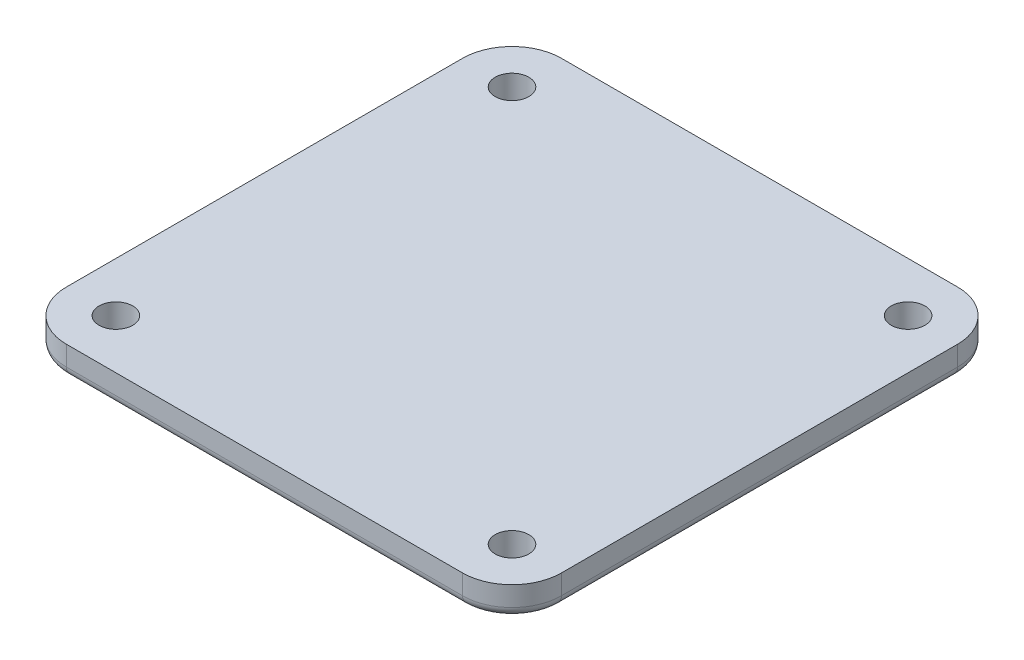
ISO-10303-21;
HEADER;
FILE_DESCRIPTION(('STEP AP214'),'2;1');
FILE_NAME('part.step','',(''),(''),'','','');
FILE_SCHEMA(('AUTOMOTIVE_DESIGN { 1 0 10303 214 1 1 1 1 }'));
ENDSEC;
DATA;
#1=APPLICATION_CONTEXT('core data for automotive mechanical design processes');
#2=APPLICATION_PROTOCOL_DEFINITION('international standard','automotive_design',2000,#1);
#3=PRODUCT_CONTEXT('',#1,'mechanical');
#4=PRODUCT('Part','Part','',(#3));
#5=PRODUCT_RELATED_PRODUCT_CATEGORY('part','',(#4));
#6=PRODUCT_DEFINITION_FORMATION('','',#4);
#7=PRODUCT_DEFINITION_CONTEXT('part definition',#1,'design');
#8=PRODUCT_DEFINITION('design','',#6,#7);
#9=PRODUCT_DEFINITION_SHAPE('','',#8);
#10=(LENGTH_UNIT() NAMED_UNIT(*) SI_UNIT(.MILLI.,.METRE.));
#11=(NAMED_UNIT(*) PLANE_ANGLE_UNIT() SI_UNIT($,.RADIAN.));
#12=(NAMED_UNIT(*) SI_UNIT($,.STERADIAN.) SOLID_ANGLE_UNIT());
#13=UNCERTAINTY_MEASURE_WITH_UNIT(LENGTH_MEASURE(1.E-05),#10,'distance_accuracy_value','');
#14=(GEOMETRIC_REPRESENTATION_CONTEXT(3) GLOBAL_UNCERTAINTY_ASSIGNED_CONTEXT((#13)) GLOBAL_UNIT_ASSIGNED_CONTEXT((#10,
#11,#12)) REPRESENTATION_CONTEXT('',''));
#15=CARTESIAN_POINT('',(0.,0.,0.));
#16=DIRECTION('',(0.,0.,1.));
#17=DIRECTION('',(1.,0.,0.));
#18=AXIS2_PLACEMENT_3D('',#15,#16,#17);
#19=CARTESIAN_POINT('',(-20.,-7.,-20.));
#20=DIRECTION('',(0.,-1.,0.));
#21=DIRECTION('',(0.,0.,-1.));
#22=AXIS2_PLACEMENT_3D('',#19,#20,#21);
#23=PLANE('',#22);
#24=DIRECTION('',(0.,0.,-1.));
#25=VECTOR('',#24,1.);
#26=CARTESIAN_POINT('',(-24.,-7.,-20.));
#27=LINE('',#26,#25);
#28=CARTESIAN_POINT('',(-24.,-7.,20.));
#29=VERTEX_POINT('',#28);
#30=CARTESIAN_POINT('',(-24.,-7.,-20.));
#31=VERTEX_POINT('',#30);
#32=EDGE_CURVE('E194',#29,#31,#27,.T.);
#33=ORIENTED_EDGE('',*,*,#32,.T.);
#34=CARTESIAN_POINT('',(-20.,-7.,-20.));
#35=DIRECTION('',(0.,-1.,0.));
#36=DIRECTION('',(0.,0.,-1.));
#37=AXIS2_PLACEMENT_3D('',#34,#35,#36);
#38=CIRCLE('',#37,4.);
#39=CARTESIAN_POINT('',(-20.,-7.,-24.));
#40=VERTEX_POINT('',#39);
#41=EDGE_CURVE('E196',#31,#40,#38,.T.);
#42=ORIENTED_EDGE('',*,*,#41,.T.);
#43=DIRECTION('',(1.,0.,0.));
#44=VECTOR('',#43,1.);
#45=CARTESIAN_POINT('',(20.,-7.,-24.));
#46=LINE('',#45,#44);
#47=CARTESIAN_POINT('',(20.,-7.,-24.));
#48=VERTEX_POINT('',#47);
#49=EDGE_CURVE('E132',#40,#48,#46,.T.);
#50=ORIENTED_EDGE('',*,*,#49,.T.);
#51=CARTESIAN_POINT('',(20.,-7.,-20.));
#52=DIRECTION('',(0.,-1.,0.));
#53=DIRECTION('',(0.,0.,-1.));
#54=AXIS2_PLACEMENT_3D('',#51,#52,#53);
#55=CIRCLE('',#54,4.);
#56=CARTESIAN_POINT('',(24.,-7.,-20.));
#57=VERTEX_POINT('',#56);
#58=EDGE_CURVE('E184',#48,#57,#55,.T.);
#59=ORIENTED_EDGE('',*,*,#58,.T.);
#60=DIRECTION('',(0.,0.,1.));
#61=VECTOR('',#60,1.);
#62=CARTESIAN_POINT('',(24.,-7.,20.));
#63=LINE('',#62,#61);
#64=CARTESIAN_POINT('',(24.,-7.,20.));
#65=VERTEX_POINT('',#64);
#66=EDGE_CURVE('E186',#57,#65,#63,.T.);
#67=ORIENTED_EDGE('',*,*,#66,.T.);
#68=CARTESIAN_POINT('',(20.,-7.,20.));
#69=DIRECTION('',(0.,-1.,0.));
#70=DIRECTION('',(0.,0.,-1.));
#71=AXIS2_PLACEMENT_3D('',#68,#69,#70);
#72=CIRCLE('',#71,4.);
#73=CARTESIAN_POINT('',(20.,-7.,24.));
#74=VERTEX_POINT('',#73);
#75=EDGE_CURVE('E188',#65,#74,#72,.T.);
#76=ORIENTED_EDGE('',*,*,#75,.T.);
#77=DIRECTION('',(-1.,0.,0.));
#78=VECTOR('',#77,1.);
#79=CARTESIAN_POINT('',(-20.,-7.,24.));
#80=LINE('',#79,#78);
#81=CARTESIAN_POINT('',(-20.,-7.,24.));
#82=VERTEX_POINT('',#81);
#83=EDGE_CURVE('E190',#74,#82,#80,.T.);
#84=ORIENTED_EDGE('',*,*,#83,.T.);
#85=CARTESIAN_POINT('',(-20.,-7.,20.));
#86=DIRECTION('',(0.,-1.,0.));
#87=DIRECTION('',(0.,0.,-1.));
#88=AXIS2_PLACEMENT_3D('',#85,#86,#87);
#89=CIRCLE('',#88,4.);
#90=EDGE_CURVE('E192',#82,#29,#89,.T.);
#91=ORIENTED_EDGE('',*,*,#90,.T.);
#92=EDGE_LOOP('',(#33,#42,#50,#59,#67,#76,#84,#91));
#93=FACE_BOUND('',#92,.T.);
#94=CARTESIAN_POINT('',(-20.,-7.,-20.));
#95=DIRECTION('',(0.,-1.,0.));
#96=DIRECTION('',(0.,0.,-1.));
#97=AXIS2_PLACEMENT_3D('',#94,#95,#96);
#98=CIRCLE('',#97,1.7);
#99=CARTESIAN_POINT('',(-20.,-7.,-21.7));
#100=VERTEX_POINT('',#99);
#101=EDGE_CURVE('E246',#100,#100,#98,.T.);
#102=ORIENTED_EDGE('',*,*,#101,.F.);
#103=EDGE_LOOP('',(#102));
#104=FACE_BOUND('',#103,.T.);
#105=CARTESIAN_POINT('',(-20.,-7.,20.));
#106=DIRECTION('',(0.,-1.,0.));
#107=DIRECTION('',(0.,0.,-1.));
#108=AXIS2_PLACEMENT_3D('',#105,#106,#107);
#109=CIRCLE('',#108,1.7);
#110=CARTESIAN_POINT('',(-20.,-7.,18.3));
#111=VERTEX_POINT('',#110);
#112=EDGE_CURVE('E149',#111,#111,#109,.T.);
#113=ORIENTED_EDGE('',*,*,#112,.F.);
#114=EDGE_LOOP('',(#113));
#115=FACE_BOUND('',#114,.T.);
#116=CARTESIAN_POINT('',(20.,-7.,20.));
#117=DIRECTION('',(0.,-1.,0.));
#118=DIRECTION('',(0.,0.,-1.));
#119=AXIS2_PLACEMENT_3D('',#116,#117,#118);
#120=CIRCLE('',#119,1.7);
#121=CARTESIAN_POINT('',(20.,-7.,18.3));
#122=VERTEX_POINT('',#121);
#123=EDGE_CURVE('E252',#122,#122,#120,.T.);
#124=ORIENTED_EDGE('',*,*,#123,.F.);
#125=EDGE_LOOP('',(#124));
#126=FACE_BOUND('',#125,.T.);
#127=CARTESIAN_POINT('',(20.,-7.,-20.));
#128=DIRECTION('',(0.,-1.,0.));
#129=DIRECTION('',(0.,0.,-1.));
#130=AXIS2_PLACEMENT_3D('',#127,#128,#129);
#131=CIRCLE('',#130,1.7);
#132=CARTESIAN_POINT('',(20.,-7.,-21.7));
#133=VERTEX_POINT('',#132);
#134=EDGE_CURVE('E238',#133,#133,#131,.T.);
#135=ORIENTED_EDGE('',*,*,#134,.F.);
#136=EDGE_LOOP('',(#135));
#137=FACE_BOUND('',#136,.T.);
#138=ADVANCED_FACE('F32',(#93,#104,#115,#126,#137),#23,.T.);
#139=CARTESIAN_POINT('',(-20.,-4.,-20.));
#140=DIRECTION('',(0.,-1.,0.));
#141=DIRECTION('',(0.,0.,-1.));
#142=AXIS2_PLACEMENT_3D('',#139,#140,#141);
#143=PLANE('',#142);
#144=CARTESIAN_POINT('',(-20.,-4.,-20.));
#145=DIRECTION('',(0.,-1.,0.));
#146=DIRECTION('',(0.,0.,-1.));
#147=AXIS2_PLACEMENT_3D('',#144,#145,#146);
#148=CIRCLE('',#147,5.);
#149=CARTESIAN_POINT('',(-25.,-4.,-20.));
#150=VERTEX_POINT('',#149);
#151=CARTESIAN_POINT('',(-20.,-4.,-25.));
#152=VERTEX_POINT('',#151);
#153=EDGE_CURVE('E140',#150,#152,#148,.T.);
#154=ORIENTED_EDGE('',*,*,#153,.F.);
#155=DIRECTION('',(0.,0.,-1.));
#156=VECTOR('',#155,1.);
#157=CARTESIAN_POINT('',(-25.,-4.,20.));
#158=LINE('',#157,#156);
#159=CARTESIAN_POINT('',(-25.,-4.,20.));
#160=VERTEX_POINT('',#159);
#161=EDGE_CURVE('E169',#160,#150,#158,.T.);
#162=ORIENTED_EDGE('',*,*,#161,.F.);
#163=CARTESIAN_POINT('',(-20.,-4.,20.));
#164=DIRECTION('',(0.,-1.,0.));
#165=DIRECTION('',(0.,0.,-1.));
#166=AXIS2_PLACEMENT_3D('',#163,#164,#165);
#167=CIRCLE('',#166,5.);
#168=CARTESIAN_POINT('',(-20.,-4.,25.));
#169=VERTEX_POINT('',#168);
#170=EDGE_CURVE('E166',#169,#160,#167,.T.);
#171=ORIENTED_EDGE('',*,*,#170,.F.);
#172=DIRECTION('',(-1.,0.,0.));
#173=VECTOR('',#172,1.);
#174=CARTESIAN_POINT('',(20.,-4.,25.));
#175=LINE('',#174,#173);
#176=CARTESIAN_POINT('',(20.,-4.,25.));
#177=VERTEX_POINT('',#176);
#178=EDGE_CURVE('E163',#177,#169,#175,.T.);
#179=ORIENTED_EDGE('',*,*,#178,.F.);
#180=CARTESIAN_POINT('',(20.,-4.,20.));
#181=DIRECTION('',(0.,-1.,0.));
#182=DIRECTION('',(0.,0.,-1.));
#183=AXIS2_PLACEMENT_3D('',#180,#181,#182);
#184=CIRCLE('',#183,5.);
#185=CARTESIAN_POINT('',(25.,-4.,20.));
#186=VERTEX_POINT('',#185);
#187=EDGE_CURVE('E160',#186,#177,#184,.T.);
#188=ORIENTED_EDGE('',*,*,#187,.F.);
#189=DIRECTION('',(0.,0.,1.));
#190=VECTOR('',#189,1.);
#191=CARTESIAN_POINT('',(25.,-4.,-20.));
#192=LINE('',#191,#190);
#193=CARTESIAN_POINT('',(25.,-4.,-20.));
#194=VERTEX_POINT('',#193);
#195=EDGE_CURVE('E157',#194,#186,#192,.T.);
#196=ORIENTED_EDGE('',*,*,#195,.F.);
#197=CARTESIAN_POINT('',(20.,-4.,-20.));
#198=DIRECTION('',(0.,-1.,0.));
#199=DIRECTION('',(0.,0.,-1.));
#200=AXIS2_PLACEMENT_3D('',#197,#198,#199);
#201=CIRCLE('',#200,5.);
#202=CARTESIAN_POINT('',(20.,-4.,-25.));
#203=VERTEX_POINT('',#202);
#204=EDGE_CURVE('E143',#203,#194,#201,.T.);
#205=ORIENTED_EDGE('',*,*,#204,.F.);
#206=DIRECTION('',(1.,0.,0.));
#207=VECTOR('',#206,1.);
#208=CARTESIAN_POINT('',(-20.,-4.,-25.));
#209=LINE('',#208,#207);
#210=EDGE_CURVE('E125',#152,#203,#209,.T.);
#211=ORIENTED_EDGE('',*,*,#210,.F.);
#212=EDGE_LOOP('',(#154,#162,#171,#179,#188,#196,#205,#211));
#213=FACE_BOUND('',#212,.T.);
#214=CARTESIAN_POINT('',(-20.,-4.,20.));
#215=DIRECTION('',(0.,-1.,0.));
#216=DIRECTION('',(0.,0.,-1.));
#217=AXIS2_PLACEMENT_3D('',#214,#215,#216);
#218=CIRCLE('',#217,1.7);
#219=CARTESIAN_POINT('',(-20.,-4.,18.3));
#220=VERTEX_POINT('',#219);
#221=EDGE_CURVE('E152',#220,#220,#218,.T.);
#222=ORIENTED_EDGE('',*,*,#221,.T.);
#223=EDGE_LOOP('',(#222));
#224=FACE_BOUND('',#223,.T.);
#225=CARTESIAN_POINT('',(20.,-4.,20.));
#226=DIRECTION('',(0.,-1.,0.));
#227=DIRECTION('',(0.,0.,-1.));
#228=AXIS2_PLACEMENT_3D('',#225,#226,#227);
#229=CIRCLE('',#228,1.7);
#230=CARTESIAN_POINT('',(20.,-4.,18.3));
#231=VERTEX_POINT('',#230);
#232=EDGE_CURVE('E249',#231,#231,#229,.T.);
#233=ORIENTED_EDGE('',*,*,#232,.T.);
#234=EDGE_LOOP('',(#233));
#235=FACE_BOUND('',#234,.T.);
#236=CARTESIAN_POINT('',(-20.,-4.,-20.));
#237=DIRECTION('',(0.,-1.,0.));
#238=DIRECTION('',(0.,0.,-1.));
#239=AXIS2_PLACEMENT_3D('',#236,#237,#238);
#240=CIRCLE('',#239,1.7);
#241=CARTESIAN_POINT('',(-20.,-4.,-21.7));
#242=VERTEX_POINT('',#241);
#243=EDGE_CURVE('E243',#242,#242,#240,.T.);
#244=ORIENTED_EDGE('',*,*,#243,.T.);
#245=EDGE_LOOP('',(#244));
#246=FACE_BOUND('',#245,.T.);
#247=CARTESIAN_POINT('',(20.,-4.,-20.));
#248=DIRECTION('',(0.,-1.,0.));
#249=DIRECTION('',(0.,0.,-1.));
#250=AXIS2_PLACEMENT_3D('',#247,#248,#249);
#251=CIRCLE('',#250,1.7);
#252=CARTESIAN_POINT('',(20.,-4.,-21.7));
#253=VERTEX_POINT('',#252);
#254=EDGE_CURVE('E232',#253,#253,#251,.T.);
#255=ORIENTED_EDGE('',*,*,#254,.T.);
#256=EDGE_LOOP('',(#255));
#257=FACE_BOUND('',#256,.T.);
#258=ADVANCED_FACE('F137',(#213,#224,#235,#246,#257),#143,.F.);
#259=CARTESIAN_POINT('',(-20.,-7.,-20.));
#260=DIRECTION('',(0.,1.,0.));
#261=DIRECTION('',(0.,0.,1.));
#262=AXIS2_PLACEMENT_3D('',#259,#260,#261);
#263=CYLINDRICAL_SURFACE('',#262,5.);
#264=DIRECTION('',(0.,1.,0.));
#265=VECTOR('',#264,1.);
#266=CARTESIAN_POINT('',(-20.,-7.,-25.));
#267=LINE('',#266,#265);
#268=CARTESIAN_POINT('',(-20.,-6.,-25.));
#269=VERTEX_POINT('',#268);
#270=EDGE_CURVE('E122',#269,#152,#267,.T.);
#271=ORIENTED_EDGE('',*,*,#270,.F.);
#272=CARTESIAN_POINT('',(-20.,-6.,-20.));
#273=DIRECTION('',(0.,-1.,0.));
#274=DIRECTION('',(0.,0.,-1.));
#275=AXIS2_PLACEMENT_3D('',#272,#273,#274);
#276=CIRCLE('',#275,5.);
#277=CARTESIAN_POINT('',(-25.,-6.,-20.));
#278=VERTEX_POINT('',#277);
#279=EDGE_CURVE('E199',#269,#278,#276,.F.);
#280=ORIENTED_EDGE('',*,*,#279,.T.);
#281=DIRECTION('',(0.,1.,0.));
#282=VECTOR('',#281,1.);
#283=CARTESIAN_POINT('',(-25.,-7.,-20.));
#284=LINE('',#283,#282);
#285=EDGE_CURVE('E147',#278,#150,#284,.T.);
#286=ORIENTED_EDGE('',*,*,#285,.T.);
#287=ORIENTED_EDGE('',*,*,#153,.T.);
#288=EDGE_LOOP('',(#271,#280,#286,#287));
#289=FACE_BOUND('',#288,.T.);
#290=ADVANCED_FACE('F145',(#289),#263,.T.);
#291=CARTESIAN_POINT('',(-20.,-7.,-25.));
#292=DIRECTION('',(0.,0.,1.));
#293=DIRECTION('',(1.,0.,0.));
#294=AXIS2_PLACEMENT_3D('',#291,#292,#293);
#295=PLANE('',#294);
#296=DIRECTION('',(0.,1.,0.));
#297=VECTOR('',#296,1.);
#298=CARTESIAN_POINT('',(20.,-7.,-25.));
#299=LINE('',#298,#297);
#300=CARTESIAN_POINT('',(20.,-6.,-25.));
#301=VERTEX_POINT('',#300);
#302=EDGE_CURVE('E133',#301,#203,#299,.T.);
#303=ORIENTED_EDGE('',*,*,#302,.F.);
#304=DIRECTION('',(1.,0.,0.));
#305=VECTOR('',#304,1.);
#306=CARTESIAN_POINT('',(-20.,-6.,-25.));
#307=LINE('',#306,#305);
#308=EDGE_CURVE('E11',#301,#269,#307,.F.);
#309=ORIENTED_EDGE('',*,*,#308,.T.);
#310=ORIENTED_EDGE('',*,*,#270,.T.);
#311=ORIENTED_EDGE('',*,*,#210,.T.);
#312=EDGE_LOOP('',(#303,#309,#310,#311));
#313=FACE_BOUND('',#312,.T.);
#314=ADVANCED_FACE('F124',(#313),#295,.F.);
#315=CARTESIAN_POINT('',(20.,-7.,-20.));
#316=DIRECTION('',(0.,1.,0.));
#317=DIRECTION('',(0.,0.,1.));
#318=AXIS2_PLACEMENT_3D('',#315,#316,#317);
#319=CYLINDRICAL_SURFACE('',#318,5.);
#320=DIRECTION('',(0.,1.,0.));
#321=VECTOR('',#320,1.);
#322=CARTESIAN_POINT('',(25.,-7.,-20.));
#323=LINE('',#322,#321);
#324=CARTESIAN_POINT('',(25.,-6.,-20.));
#325=VERTEX_POINT('',#324);
#326=EDGE_CURVE('E180',#325,#194,#323,.T.);
#327=ORIENTED_EDGE('',*,*,#326,.F.);
#328=CARTESIAN_POINT('',(20.,-6.,-20.));
#329=DIRECTION('',(0.,-1.,0.));
#330=DIRECTION('',(0.,0.,-1.));
#331=AXIS2_PLACEMENT_3D('',#328,#329,#330);
#332=CIRCLE('',#331,5.);
#333=EDGE_CURVE('E41',#325,#301,#332,.F.);
#334=ORIENTED_EDGE('',*,*,#333,.T.);
#335=ORIENTED_EDGE('',*,*,#302,.T.);
#336=ORIENTED_EDGE('',*,*,#204,.T.);
#337=EDGE_LOOP('',(#327,#334,#335,#336));
#338=FACE_BOUND('',#337,.T.);
#339=ADVANCED_FACE('F303',(#338),#319,.T.);
#340=CARTESIAN_POINT('',(25.,-7.,-20.));
#341=DIRECTION('',(-1.,0.,0.));
#342=DIRECTION('',(0.,0.,1.));
#343=AXIS2_PLACEMENT_3D('',#340,#341,#342);
#344=PLANE('',#343);
#345=DIRECTION('',(0.,1.,0.));
#346=VECTOR('',#345,1.);
#347=CARTESIAN_POINT('',(25.,-7.,20.));
#348=LINE('',#347,#346);
#349=CARTESIAN_POINT('',(25.,-6.,20.));
#350=VERTEX_POINT('',#349);
#351=EDGE_CURVE('E178',#350,#186,#348,.T.);
#352=ORIENTED_EDGE('',*,*,#351,.F.);
#353=DIRECTION('',(0.,0.,1.));
#354=VECTOR('',#353,1.);
#355=CARTESIAN_POINT('',(25.,-6.,-20.));
#356=LINE('',#355,#354);
#357=EDGE_CURVE('E56',#350,#325,#356,.F.);
#358=ORIENTED_EDGE('',*,*,#357,.T.);
#359=ORIENTED_EDGE('',*,*,#326,.T.);
#360=ORIENTED_EDGE('',*,*,#195,.T.);
#361=EDGE_LOOP('',(#352,#358,#359,#360));
#362=FACE_BOUND('',#361,.T.);
#363=ADVANCED_FACE('F299',(#362),#344,.F.);
#364=CARTESIAN_POINT('',(20.,-7.,20.));
#365=DIRECTION('',(0.,1.,0.));
#366=DIRECTION('',(0.,0.,1.));
#367=AXIS2_PLACEMENT_3D('',#364,#365,#366);
#368=CYLINDRICAL_SURFACE('',#367,5.);
#369=DIRECTION('',(0.,1.,0.));
#370=VECTOR('',#369,1.);
#371=CARTESIAN_POINT('',(20.,-7.,25.));
#372=LINE('',#371,#370);
#373=CARTESIAN_POINT('',(20.,-6.,25.));
#374=VERTEX_POINT('',#373);
#375=EDGE_CURVE('E176',#374,#177,#372,.T.);
#376=ORIENTED_EDGE('',*,*,#375,.F.);
#377=CARTESIAN_POINT('',(20.,-6.,20.));
#378=DIRECTION('',(0.,-1.,0.));
#379=DIRECTION('',(0.,0.,-1.));
#380=AXIS2_PLACEMENT_3D('',#377,#378,#379);
#381=CIRCLE('',#380,5.);
#382=EDGE_CURVE('E207',#374,#350,#381,.F.);
#383=ORIENTED_EDGE('',*,*,#382,.T.);
#384=ORIENTED_EDGE('',*,*,#351,.T.);
#385=ORIENTED_EDGE('',*,*,#187,.T.);
#386=EDGE_LOOP('',(#376,#383,#384,#385));
#387=FACE_BOUND('',#386,.T.);
#388=ADVANCED_FACE('F295',(#387),#368,.T.);
#389=CARTESIAN_POINT('',(20.,-7.,25.));
#390=DIRECTION('',(0.,0.,-1.));
#391=DIRECTION('',(-1.,0.,0.));
#392=AXIS2_PLACEMENT_3D('',#389,#390,#391);
#393=PLANE('',#392);
#394=DIRECTION('',(0.,1.,0.));
#395=VECTOR('',#394,1.);
#396=CARTESIAN_POINT('',(-20.,-7.,25.));
#397=LINE('',#396,#395);
#398=CARTESIAN_POINT('',(-20.,-6.,25.));
#399=VERTEX_POINT('',#398);
#400=EDGE_CURVE('E174',#399,#169,#397,.T.);
#401=ORIENTED_EDGE('',*,*,#400,.F.);
#402=DIRECTION('',(-1.,0.,0.));
#403=VECTOR('',#402,1.);
#404=CARTESIAN_POINT('',(20.,-6.,25.));
#405=LINE('',#404,#403);
#406=EDGE_CURVE('E205',#399,#374,#405,.F.);
#407=ORIENTED_EDGE('',*,*,#406,.T.);
#408=ORIENTED_EDGE('',*,*,#375,.T.);
#409=ORIENTED_EDGE('',*,*,#178,.T.);
#410=EDGE_LOOP('',(#401,#407,#408,#409));
#411=FACE_BOUND('',#410,.T.);
#412=ADVANCED_FACE('F291',(#411),#393,.F.);
#413=CARTESIAN_POINT('',(-20.,-7.,20.));
#414=DIRECTION('',(0.,1.,0.));
#415=DIRECTION('',(0.,0.,1.));
#416=AXIS2_PLACEMENT_3D('',#413,#414,#415);
#417=CYLINDRICAL_SURFACE('',#416,5.);
#418=DIRECTION('',(0.,1.,0.));
#419=VECTOR('',#418,1.);
#420=CARTESIAN_POINT('',(-25.,-7.,20.));
#421=LINE('',#420,#419);
#422=CARTESIAN_POINT('',(-25.,-6.,20.));
#423=VERTEX_POINT('',#422);
#424=EDGE_CURVE('E172',#423,#160,#421,.T.);
#425=ORIENTED_EDGE('',*,*,#424,.F.);
#426=CARTESIAN_POINT('',(-20.,-6.,20.));
#427=DIRECTION('',(0.,-1.,0.));
#428=DIRECTION('',(0.,0.,-1.));
#429=AXIS2_PLACEMENT_3D('',#426,#427,#428);
#430=CIRCLE('',#429,5.);
#431=EDGE_CURVE('E203',#423,#399,#430,.F.);
#432=ORIENTED_EDGE('',*,*,#431,.T.);
#433=ORIENTED_EDGE('',*,*,#400,.T.);
#434=ORIENTED_EDGE('',*,*,#170,.T.);
#435=EDGE_LOOP('',(#425,#432,#433,#434));
#436=FACE_BOUND('',#435,.T.);
#437=ADVANCED_FACE('F287',(#436),#417,.T.);
#438=CARTESIAN_POINT('',(-25.,-7.,20.));
#439=DIRECTION('',(1.,0.,0.));
#440=DIRECTION('',(0.,0.,-1.));
#441=AXIS2_PLACEMENT_3D('',#438,#439,#440);
#442=PLANE('',#441);
#443=ORIENTED_EDGE('',*,*,#285,.F.);
#444=DIRECTION('',(0.,0.,-1.));
#445=VECTOR('',#444,1.);
#446=CARTESIAN_POINT('',(-25.,-6.,20.));
#447=LINE('',#446,#445);
#448=EDGE_CURVE('E201',#278,#423,#447,.F.);
#449=ORIENTED_EDGE('',*,*,#448,.T.);
#450=ORIENTED_EDGE('',*,*,#424,.T.);
#451=ORIENTED_EDGE('',*,*,#161,.T.);
#452=EDGE_LOOP('',(#443,#449,#450,#451));
#453=FACE_BOUND('',#452,.T.);
#454=ADVANCED_FACE('F273',(#453),#442,.F.);
#455=CARTESIAN_POINT('',(-20.,-7.,20.));
#456=DIRECTION('',(0.,1.,0.));
#457=DIRECTION('',(0.,0.,1.));
#458=AXIS2_PLACEMENT_3D('',#455,#456,#457);
#459=CYLINDRICAL_SURFACE('',#458,1.7);
#460=ORIENTED_EDGE('',*,*,#112,.T.);
#461=EDGE_LOOP('',(#460));
#462=FACE_BOUND('',#461,.T.);
#463=ORIENTED_EDGE('',*,*,#221,.F.);
#464=EDGE_LOOP('',(#463));
#465=FACE_BOUND('',#464,.T.);
#466=ADVANCED_FACE('F263',(#462,#465),#459,.F.);
#467=CARTESIAN_POINT('',(20.,-7.,20.));
#468=DIRECTION('',(0.,1.,0.));
#469=DIRECTION('',(0.,0.,1.));
#470=AXIS2_PLACEMENT_3D('',#467,#468,#469);
#471=CYLINDRICAL_SURFACE('',#470,1.7);
#472=ORIENTED_EDGE('',*,*,#123,.T.);
#473=EDGE_LOOP('',(#472));
#474=FACE_BOUND('',#473,.T.);
#475=ORIENTED_EDGE('',*,*,#232,.F.);
#476=EDGE_LOOP('',(#475));
#477=FACE_BOUND('',#476,.T.);
#478=ADVANCED_FACE('F260',(#474,#477),#471,.F.);
#479=CARTESIAN_POINT('',(-20.,-7.,-20.));
#480=DIRECTION('',(0.,1.,0.));
#481=DIRECTION('',(0.,0.,1.));
#482=AXIS2_PLACEMENT_3D('',#479,#480,#481);
#483=CYLINDRICAL_SURFACE('',#482,1.7);
#484=ORIENTED_EDGE('',*,*,#101,.T.);
#485=EDGE_LOOP('',(#484));
#486=FACE_BOUND('',#485,.T.);
#487=ORIENTED_EDGE('',*,*,#243,.F.);
#488=EDGE_LOOP('',(#487));
#489=FACE_BOUND('',#488,.T.);
#490=ADVANCED_FACE('F262',(#486,#489),#483,.F.);
#491=CARTESIAN_POINT('',(20.,-7.,-20.));
#492=DIRECTION('',(0.,1.,0.));
#493=DIRECTION('',(0.,0.,1.));
#494=AXIS2_PLACEMENT_3D('',#491,#492,#493);
#495=CYLINDRICAL_SURFACE('',#494,1.7);
#496=ORIENTED_EDGE('',*,*,#134,.T.);
#497=EDGE_LOOP('',(#496));
#498=FACE_BOUND('',#497,.T.);
#499=ORIENTED_EDGE('',*,*,#254,.F.);
#500=EDGE_LOOP('',(#499));
#501=FACE_BOUND('',#500,.T.);
#502=ADVANCED_FACE('F270',(#498,#501),#495,.F.);
#503=CARTESIAN_POINT('',(20.,-6.,20.));
#504=DIRECTION('',(0.,-1.,0.));
#505=DIRECTION('',(0.,0.,-1.));
#506=AXIS2_PLACEMENT_3D('',#503,#504,#505);
#507=TOROIDAL_SURFACE('',#506,4.,1.);
#508=CARTESIAN_POINT('',(24.,-6.,20.));
#509=DIRECTION('',(0.,0.,-1.));
#510=DIRECTION('',(-1.,0.,0.));
#511=AXIS2_PLACEMENT_3D('',#508,#509,#510);
#512=CIRCLE('',#511,1.);
#513=EDGE_CURVE('E226',#350,#65,#512,.T.);
#514=ORIENTED_EDGE('',*,*,#513,.F.);
#515=ORIENTED_EDGE('',*,*,#382,.F.);
#516=CARTESIAN_POINT('',(20.,-6.,24.));
#517=DIRECTION('',(-1.,0.,0.));
#518=DIRECTION('',(0.,0.,1.));
#519=AXIS2_PLACEMENT_3D('',#516,#517,#518);
#520=CIRCLE('',#519,1.);
#521=EDGE_CURVE('E36',#74,#374,#520,.T.);
#522=ORIENTED_EDGE('',*,*,#521,.F.);
#523=ORIENTED_EDGE('',*,*,#75,.F.);
#524=EDGE_LOOP('',(#514,#515,#522,#523));
#525=FACE_BOUND('',#524,.T.);
#526=ADVANCED_FACE('F34',(#525),#507,.T.);
#527=CARTESIAN_POINT('',(-20.,-6.,24.));
#528=DIRECTION('',(1.,0.,0.));
#529=DIRECTION('',(0.,0.,-1.));
#530=AXIS2_PLACEMENT_3D('',#527,#528,#529);
#531=CYLINDRICAL_SURFACE('',#530,1.);
#532=ORIENTED_EDGE('',*,*,#521,.T.);
#533=ORIENTED_EDGE('',*,*,#406,.F.);
#534=CARTESIAN_POINT('',(-20.,-6.,24.));
#535=DIRECTION('',(-1.,0.,0.));
#536=DIRECTION('',(0.,0.,1.));
#537=AXIS2_PLACEMENT_3D('',#534,#535,#536);
#538=CIRCLE('',#537,1.);
#539=EDGE_CURVE('E224',#82,#399,#538,.T.);
#540=ORIENTED_EDGE('',*,*,#539,.F.);
#541=ORIENTED_EDGE('',*,*,#83,.F.);
#542=EDGE_LOOP('',(#532,#533,#540,#541));
#543=FACE_BOUND('',#542,.T.);
#544=ADVANCED_FACE('F332',(#543),#531,.T.);
#545=CARTESIAN_POINT('',(24.,-6.,-20.));
#546=DIRECTION('',(0.,0.,-1.));
#547=DIRECTION('',(-1.,0.,0.));
#548=AXIS2_PLACEMENT_3D('',#545,#546,#547);
#549=CYLINDRICAL_SURFACE('',#548,1.);
#550=ORIENTED_EDGE('',*,*,#513,.T.);
#551=ORIENTED_EDGE('',*,*,#66,.F.);
#552=CARTESIAN_POINT('',(24.,-6.,-20.));
#553=DIRECTION('',(0.,0.,-1.));
#554=DIRECTION('',(-1.,0.,0.));
#555=AXIS2_PLACEMENT_3D('',#552,#553,#554);
#556=CIRCLE('',#555,1.);
#557=EDGE_CURVE('E221',#325,#57,#556,.T.);
#558=ORIENTED_EDGE('',*,*,#557,.F.);
#559=ORIENTED_EDGE('',*,*,#357,.F.);
#560=EDGE_LOOP('',(#550,#551,#558,#559));
#561=FACE_BOUND('',#560,.T.);
#562=ADVANCED_FACE('F329',(#561),#549,.T.);
#563=CARTESIAN_POINT('',(-20.,-6.,20.));
#564=DIRECTION('',(0.,-1.,0.));
#565=DIRECTION('',(0.,0.,-1.));
#566=AXIS2_PLACEMENT_3D('',#563,#564,#565);
#567=TOROIDAL_SURFACE('',#566,4.,1.);
#568=ORIENTED_EDGE('',*,*,#539,.T.);
#569=ORIENTED_EDGE('',*,*,#431,.F.);
#570=CARTESIAN_POINT('',(-24.,-6.,20.));
#571=DIRECTION('',(0.,0.,-1.));
#572=DIRECTION('',(-1.,0.,0.));
#573=AXIS2_PLACEMENT_3D('',#570,#571,#572);
#574=CIRCLE('',#573,1.);
#575=EDGE_CURVE('E218',#29,#423,#574,.T.);
#576=ORIENTED_EDGE('',*,*,#575,.F.);
#577=ORIENTED_EDGE('',*,*,#90,.F.);
#578=EDGE_LOOP('',(#568,#569,#576,#577));
#579=FACE_BOUND('',#578,.T.);
#580=ADVANCED_FACE('F325',(#579),#567,.T.);
#581=CARTESIAN_POINT('',(20.,-6.,-20.));
#582=DIRECTION('',(0.,-1.,0.));
#583=DIRECTION('',(0.,0.,-1.));
#584=AXIS2_PLACEMENT_3D('',#581,#582,#583);
#585=TOROIDAL_SURFACE('',#584,4.,1.);
#586=ORIENTED_EDGE('',*,*,#557,.T.);
#587=ORIENTED_EDGE('',*,*,#58,.F.);
#588=CARTESIAN_POINT('',(20.,-6.,-24.));
#589=DIRECTION('',(-1.,0.,0.));
#590=DIRECTION('',(0.,0.,1.));
#591=AXIS2_PLACEMENT_3D('',#588,#589,#590);
#592=CIRCLE('',#591,1.);
#593=EDGE_CURVE('E215',#301,#48,#592,.T.);
#594=ORIENTED_EDGE('',*,*,#593,.F.);
#595=ORIENTED_EDGE('',*,*,#333,.F.);
#596=EDGE_LOOP('',(#586,#587,#594,#595));
#597=FACE_BOUND('',#596,.T.);
#598=ADVANCED_FACE('F321',(#597),#585,.T.);
#599=CARTESIAN_POINT('',(-24.,-6.,-20.));
#600=DIRECTION('',(0.,0.,1.));
#601=DIRECTION('',(1.,0.,0.));
#602=AXIS2_PLACEMENT_3D('',#599,#600,#601);
#603=CYLINDRICAL_SURFACE('',#602,1.);
#604=ORIENTED_EDGE('',*,*,#575,.T.);
#605=ORIENTED_EDGE('',*,*,#448,.F.);
#606=CARTESIAN_POINT('',(-24.,-6.,-20.));
#607=DIRECTION('',(0.,0.,-1.));
#608=DIRECTION('',(-1.,0.,0.));
#609=AXIS2_PLACEMENT_3D('',#606,#607,#608);
#610=CIRCLE('',#609,1.);
#611=EDGE_CURVE('E213',#31,#278,#610,.T.);
#612=ORIENTED_EDGE('',*,*,#611,.F.);
#613=ORIENTED_EDGE('',*,*,#32,.F.);
#614=EDGE_LOOP('',(#604,#605,#612,#613));
#615=FACE_BOUND('',#614,.T.);
#616=ADVANCED_FACE('F317',(#615),#603,.T.);
#617=CARTESIAN_POINT('',(-20.,-6.,-24.));
#618=DIRECTION('',(-1.,0.,0.));
#619=DIRECTION('',(0.,0.,1.));
#620=AXIS2_PLACEMENT_3D('',#617,#618,#619);
#621=CYLINDRICAL_SURFACE('',#620,1.);
#622=ORIENTED_EDGE('',*,*,#593,.T.);
#623=ORIENTED_EDGE('',*,*,#49,.F.);
#624=CARTESIAN_POINT('',(-20.,-6.,-24.));
#625=DIRECTION('',(-1.,0.,0.));
#626=DIRECTION('',(0.,0.,1.));
#627=AXIS2_PLACEMENT_3D('',#624,#625,#626);
#628=CIRCLE('',#627,1.);
#629=EDGE_CURVE('E211',#269,#40,#628,.T.);
#630=ORIENTED_EDGE('',*,*,#629,.F.);
#631=ORIENTED_EDGE('',*,*,#308,.F.);
#632=EDGE_LOOP('',(#622,#623,#630,#631));
#633=FACE_BOUND('',#632,.T.);
#634=ADVANCED_FACE('F313',(#633),#621,.T.);
#635=CARTESIAN_POINT('',(-20.,-6.,-20.));
#636=DIRECTION('',(0.,-1.,0.));
#637=DIRECTION('',(0.,0.,-1.));
#638=AXIS2_PLACEMENT_3D('',#635,#636,#637);
#639=TOROIDAL_SURFACE('',#638,4.,1.);
#640=ORIENTED_EDGE('',*,*,#611,.T.);
#641=ORIENTED_EDGE('',*,*,#279,.F.);
#642=ORIENTED_EDGE('',*,*,#629,.T.);
#643=ORIENTED_EDGE('',*,*,#41,.F.);
#644=EDGE_LOOP('',(#640,#641,#642,#643));
#645=FACE_BOUND('',#644,.T.);
#646=ADVANCED_FACE('F310',(#645),#639,.T.);
#647=CLOSED_SHELL('',(#138,#258,#290,#314,#339,#363,#388,#412,#437,#454,#466,#478,#490,#502,
#526,#544,#562,#580,#598,#616,#634,#646));
#648=MANIFOLD_SOLID_BREP('B2',#647);
#649=ADVANCED_BREP_SHAPE_REPRESENTATION('',(#18,#648),#14);
#650=SHAPE_DEFINITION_REPRESENTATION(#9,#649);
ENDSEC;
END-ISO-10303-21;
